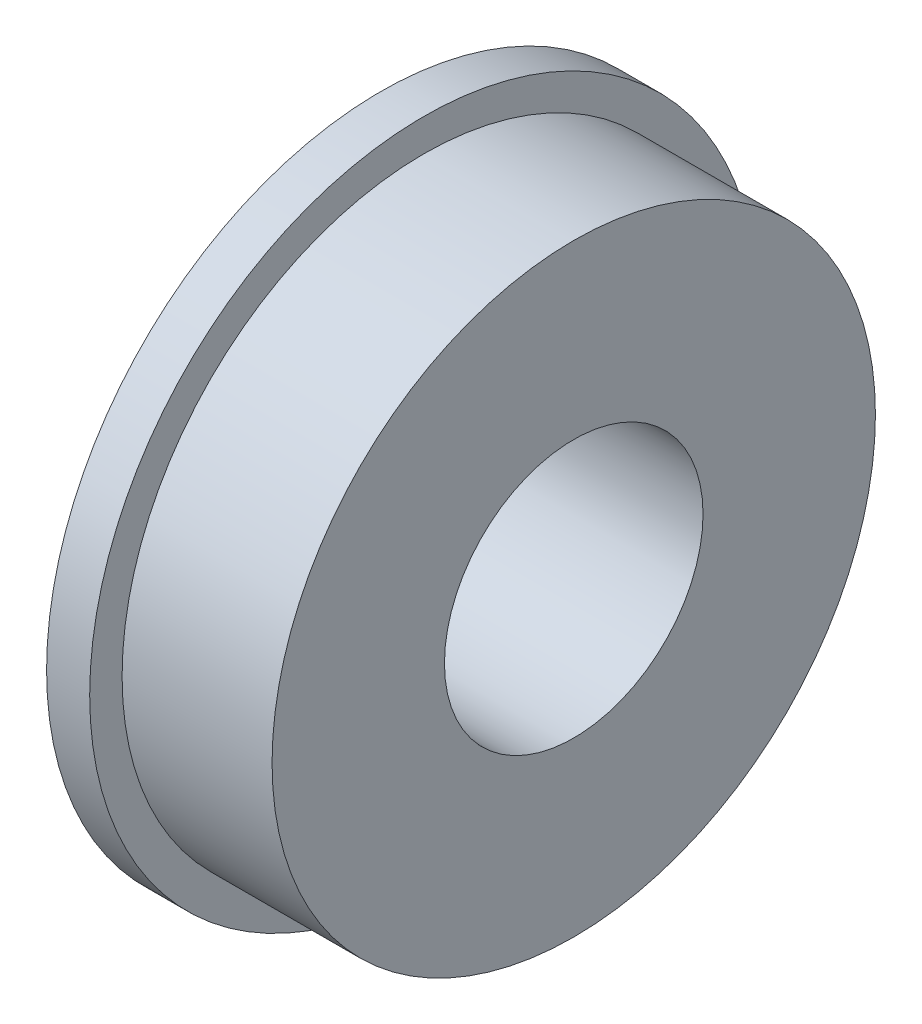
ISO-10303-21;
HEADER;
FILE_DESCRIPTION(('STEP AP214'),'2;1');
FILE_NAME('part.step','',(''),(''),'','','');
FILE_SCHEMA(('AUTOMOTIVE_DESIGN { 1 0 10303 214 1 1 1 1 }'));
ENDSEC;
DATA;
#1=APPLICATION_CONTEXT('core data for automotive mechanical design processes');
#2=APPLICATION_PROTOCOL_DEFINITION('international standard','automotive_design',2000,#1);
#3=PRODUCT_CONTEXT('',#1,'mechanical');
#4=PRODUCT('Part','Part','',(#3));
#5=PRODUCT_RELATED_PRODUCT_CATEGORY('part','',(#4));
#6=PRODUCT_DEFINITION_FORMATION('','',#4);
#7=PRODUCT_DEFINITION_CONTEXT('part definition',#1,'design');
#8=PRODUCT_DEFINITION('design','',#6,#7);
#9=PRODUCT_DEFINITION_SHAPE('','',#8);
#10=(LENGTH_UNIT() NAMED_UNIT(*) SI_UNIT(.MILLI.,.METRE.));
#11=(NAMED_UNIT(*) PLANE_ANGLE_UNIT() SI_UNIT($,.RADIAN.));
#12=(NAMED_UNIT(*) SI_UNIT($,.STERADIAN.) SOLID_ANGLE_UNIT());
#13=UNCERTAINTY_MEASURE_WITH_UNIT(LENGTH_MEASURE(1.E-05),#10,'distance_accuracy_value','');
#14=(GEOMETRIC_REPRESENTATION_CONTEXT(3) GLOBAL_UNCERTAINTY_ASSIGNED_CONTEXT((#13)) GLOBAL_UNIT_ASSIGNED_CONTEXT((#10,
#11,#12)) REPRESENTATION_CONTEXT('',''));
#15=CARTESIAN_POINT('',(0.,0.,0.));
#16=DIRECTION('',(0.,0.,1.));
#17=DIRECTION('',(1.,0.,0.));
#18=AXIS2_PLACEMENT_3D('',#15,#16,#17);
#19=CARTESIAN_POINT('',(0.,0.,0.));
#20=DIRECTION('',(-1.,0.,0.));
#21=DIRECTION('',(0.,0.,1.));
#22=AXIS2_PLACEMENT_3D('',#19,#20,#21);
#23=CYLINDRICAL_SURFACE('',#22,9.906);
#24=CARTESIAN_POINT('',(0.381,0.,0.));
#25=DIRECTION('',(-1.,0.,0.));
#26=DIRECTION('',(0.,0.,1.));
#27=AXIS2_PLACEMENT_3D('',#24,#25,#26);
#28=CIRCLE('',#27,9.906);
#29=CARTESIAN_POINT('',(0.381,0.,9.906));
#30=VERTEX_POINT('',#29);
#31=EDGE_CURVE('E46',#30,#30,#28,.F.);
#32=ORIENTED_EDGE('',*,*,#31,.T.);
#33=EDGE_LOOP('',(#32));
#34=FACE_BOUND('',#33,.T.);
#35=CARTESIAN_POINT('',(0.,0.,0.));
#36=DIRECTION('',(-1.,0.,0.));
#37=DIRECTION('',(0.,0.,1.));
#38=AXIS2_PLACEMENT_3D('',#35,#36,#37);
#39=CIRCLE('',#38,9.906);
#40=CARTESIAN_POINT('',(0.,0.,9.906));
#41=VERTEX_POINT('',#40);
#42=EDGE_CURVE('E18',#41,#41,#39,.T.);
#43=ORIENTED_EDGE('',*,*,#42,.T.);
#44=EDGE_LOOP('',(#43));
#45=FACE_BOUND('',#44,.T.);
#46=ADVANCED_FACE('F15',(#34,#45),#23,.F.);
#47=CARTESIAN_POINT('',(0.,12.3063,0.));
#48=DIRECTION('',(1.,0.,0.));
#49=DIRECTION('',(0.,0.,-1.));
#50=AXIS2_PLACEMENT_3D('',#47,#48,#49);
#51=PLANE('',#50);
#52=CARTESIAN_POINT('',(0.,0.,0.));
#53=DIRECTION('',(-1.,0.,0.));
#54=DIRECTION('',(0.,0.,1.));
#55=AXIS2_PLACEMENT_3D('',#52,#53,#54);
#56=CIRCLE('',#55,12.3063);
#57=CARTESIAN_POINT('',(0.,0.,12.3063));
#58=VERTEX_POINT('',#57);
#59=EDGE_CURVE('E44',#58,#58,#56,.F.);
#60=ORIENTED_EDGE('',*,*,#59,.F.);
#61=EDGE_LOOP('',(#60));
#62=FACE_BOUND('',#61,.T.);
#63=ORIENTED_EDGE('',*,*,#42,.F.);
#64=EDGE_LOOP('',(#63));
#65=FACE_BOUND('',#64,.T.);
#66=ADVANCED_FACE('F54',(#62,#65),#51,.F.);
#67=CARTESIAN_POINT('',(0.381,9.906,0.));
#68=DIRECTION('',(1.,0.,0.));
#69=DIRECTION('',(0.,0.,-1.));
#70=AXIS2_PLACEMENT_3D('',#67,#68,#69);
#71=PLANE('',#70);
#72=ORIENTED_EDGE('',*,*,#31,.F.);
#73=EDGE_LOOP('',(#72));
#74=FACE_BOUND('',#73,.T.);
#75=CARTESIAN_POINT('',(0.381,0.,0.));
#76=DIRECTION('',(-1.,0.,0.));
#77=DIRECTION('',(0.,0.,1.));
#78=AXIS2_PLACEMENT_3D('',#75,#76,#77);
#79=CIRCLE('',#78,6.35);
#80=CARTESIAN_POINT('',(0.381,0.,6.35));
#81=VERTEX_POINT('',#80);
#82=EDGE_CURVE('E41',#81,#81,#79,.T.);
#83=ORIENTED_EDGE('',*,*,#82,.F.);
#84=EDGE_LOOP('',(#83));
#85=FACE_BOUND('',#84,.T.);
#86=ADVANCED_FACE('F56',(#74,#85),#71,.F.);
#87=CARTESIAN_POINT('',(0.,0.,0.));
#88=DIRECTION('',(-1.,0.,0.));
#89=DIRECTION('',(0.,0.,1.));
#90=AXIS2_PLACEMENT_3D('',#87,#88,#89);
#91=CYLINDRICAL_SURFACE('',#90,12.3063);
#92=ORIENTED_EDGE('',*,*,#59,.T.);
#93=EDGE_LOOP('',(#92));
#94=FACE_BOUND('',#93,.T.);
#95=CARTESIAN_POINT('',(1.5875,0.,0.));
#96=DIRECTION('',(-1.,0.,0.));
#97=DIRECTION('',(0.,0.,1.));
#98=AXIS2_PLACEMENT_3D('',#95,#96,#97);
#99=CIRCLE('',#98,12.3063);
#100=CARTESIAN_POINT('',(1.5875,0.,12.3063));
#101=VERTEX_POINT('',#100);
#102=EDGE_CURVE('E38',#101,#101,#99,.T.);
#103=ORIENTED_EDGE('',*,*,#102,.T.);
#104=EDGE_LOOP('',(#103));
#105=FACE_BOUND('',#104,.T.);
#106=ADVANCED_FACE('F63',(#94,#105),#91,.T.);
#107=CARTESIAN_POINT('',(0.,0.,0.));
#108=DIRECTION('',(-1.,0.,0.));
#109=DIRECTION('',(0.,0.,1.));
#110=AXIS2_PLACEMENT_3D('',#107,#108,#109);
#111=CYLINDRICAL_SURFACE('',#110,6.35);
#112=CARTESIAN_POINT('',(0.,0.,0.));
#113=DIRECTION('',(-1.,0.,0.));
#114=DIRECTION('',(0.,0.,1.));
#115=AXIS2_PLACEMENT_3D('',#112,#113,#114);
#116=CIRCLE('',#115,6.35);
#117=CARTESIAN_POINT('',(0.,0.,6.35));
#118=VERTEX_POINT('',#117);
#119=EDGE_CURVE('E35',#118,#118,#116,.F.);
#120=ORIENTED_EDGE('',*,*,#119,.T.);
#121=EDGE_LOOP('',(#120));
#122=FACE_BOUND('',#121,.T.);
#123=ORIENTED_EDGE('',*,*,#82,.T.);
#124=EDGE_LOOP('',(#123));
#125=FACE_BOUND('',#124,.T.);
#126=ADVANCED_FACE('F90',(#122,#125),#111,.T.);
#127=CARTESIAN_POINT('',(1.5875,11.1125,0.));
#128=DIRECTION('',(-1.,0.,0.));
#129=DIRECTION('',(0.,0.,1.));
#130=AXIS2_PLACEMENT_3D('',#127,#128,#129);
#131=PLANE('',#130);
#132=CARTESIAN_POINT('',(1.5875,0.,0.));
#133=DIRECTION('',(-1.,0.,0.));
#134=DIRECTION('',(0.,0.,1.));
#135=AXIS2_PLACEMENT_3D('',#132,#133,#134);
#136=CIRCLE('',#135,11.1125);
#137=CARTESIAN_POINT('',(1.5875,0.,11.1125));
#138=VERTEX_POINT('',#137);
#139=EDGE_CURVE('E32',#138,#138,#136,.F.);
#140=ORIENTED_EDGE('',*,*,#139,.F.);
#141=EDGE_LOOP('',(#140));
#142=FACE_BOUND('',#141,.T.);
#143=ORIENTED_EDGE('',*,*,#102,.F.);
#144=EDGE_LOOP('',(#143));
#145=FACE_BOUND('',#144,.T.);
#146=ADVANCED_FACE('F86',(#142,#145),#131,.F.);
#147=CARTESIAN_POINT('',(0.,6.35,0.));
#148=DIRECTION('',(1.,0.,0.));
#149=DIRECTION('',(0.,0.,-1.));
#150=AXIS2_PLACEMENT_3D('',#147,#148,#149);
#151=PLANE('',#150);
#152=ORIENTED_EDGE('',*,*,#119,.F.);
#153=EDGE_LOOP('',(#152));
#154=FACE_BOUND('',#153,.T.);
#155=CARTESIAN_POINT('',(0.,0.,0.));
#156=DIRECTION('',(-1.,0.,0.));
#157=DIRECTION('',(0.,0.,1.));
#158=AXIS2_PLACEMENT_3D('',#155,#156,#157);
#159=CIRCLE('',#158,4.7625);
#160=CARTESIAN_POINT('',(0.,0.,4.7625));
#161=VERTEX_POINT('',#160);
#162=EDGE_CURVE('E27',#161,#161,#159,.F.);
#163=ORIENTED_EDGE('',*,*,#162,.T.);
#164=EDGE_LOOP('',(#163));
#165=FACE_BOUND('',#164,.T.);
#166=ADVANCED_FACE('F82',(#154,#165),#151,.F.);
#167=CARTESIAN_POINT('',(0.,0.,0.));
#168=DIRECTION('',(-1.,0.,0.));
#169=DIRECTION('',(0.,0.,1.));
#170=AXIS2_PLACEMENT_3D('',#167,#168,#169);
#171=CYLINDRICAL_SURFACE('',#170,11.1125);
#172=ORIENTED_EDGE('',*,*,#139,.T.);
#173=EDGE_LOOP('',(#172));
#174=FACE_BOUND('',#173,.T.);
#175=CARTESIAN_POINT('',(7.112,0.,0.));
#176=DIRECTION('',(-1.,0.,0.));
#177=DIRECTION('',(0.,0.,1.));
#178=AXIS2_PLACEMENT_3D('',#175,#176,#177);
#179=CIRCLE('',#178,11.1125);
#180=CARTESIAN_POINT('',(7.112,0.,11.1125));
#181=VERTEX_POINT('',#180);
#182=EDGE_CURVE('E22',#181,#181,#179,.T.);
#183=ORIENTED_EDGE('',*,*,#182,.T.);
#184=EDGE_LOOP('',(#183));
#185=FACE_BOUND('',#184,.T.);
#186=ADVANCED_FACE('F76',(#174,#185),#171,.T.);
#187=CARTESIAN_POINT('',(0.,0.,0.));
#188=DIRECTION('',(-1.,0.,0.));
#189=DIRECTION('',(0.,0.,1.));
#190=AXIS2_PLACEMENT_3D('',#187,#188,#189);
#191=CYLINDRICAL_SURFACE('',#190,4.7625);
#192=CARTESIAN_POINT('',(7.112,0.,0.));
#193=DIRECTION('',(-1.,0.,0.));
#194=DIRECTION('',(0.,0.,1.));
#195=AXIS2_PLACEMENT_3D('',#192,#193,#194);
#196=CIRCLE('',#195,4.7625);
#197=CARTESIAN_POINT('',(7.112,0.,4.7625));
#198=VERTEX_POINT('',#197);
#199=EDGE_CURVE('E10',#198,#198,#196,.F.);
#200=ORIENTED_EDGE('',*,*,#199,.T.);
#201=EDGE_LOOP('',(#200));
#202=FACE_BOUND('',#201,.T.);
#203=ORIENTED_EDGE('',*,*,#162,.F.);
#204=EDGE_LOOP('',(#203));
#205=FACE_BOUND('',#204,.T.);
#206=ADVANCED_FACE('F70',(#202,#205),#191,.F.);
#207=CARTESIAN_POINT('',(7.112,4.7625,0.));
#208=DIRECTION('',(-1.,0.,0.));
#209=DIRECTION('',(0.,0.,1.));
#210=AXIS2_PLACEMENT_3D('',#207,#208,#209);
#211=PLANE('',#210);
#212=ORIENTED_EDGE('',*,*,#199,.F.);
#213=EDGE_LOOP('',(#212));
#214=FACE_BOUND('',#213,.T.);
#215=ORIENTED_EDGE('',*,*,#182,.F.);
#216=EDGE_LOOP('',(#215));
#217=FACE_BOUND('',#216,.T.);
#218=ADVANCED_FACE('F68',(#214,#217),#211,.F.);
#219=CLOSED_SHELL('',(#46,#66,#86,#106,#126,#146,#166,#186,#206,#218));
#220=MANIFOLD_SOLID_BREP('B1',#219);
#221=ADVANCED_BREP_SHAPE_REPRESENTATION('',(#18,#220),#14);
#222=SHAPE_DEFINITION_REPRESENTATION(#9,#221);
ENDSEC;
END-ISO-10303-21;
